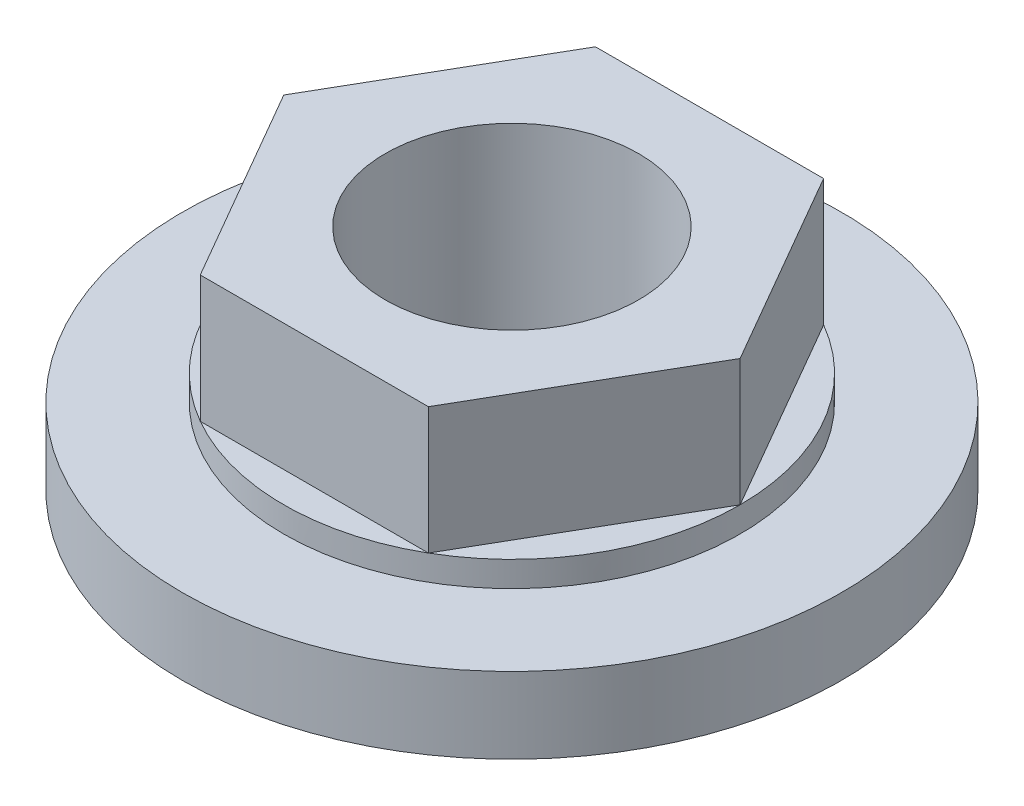
ISO-10303-21;
HEADER;
FILE_DESCRIPTION(('STEP AP214'),'2;1');
FILE_NAME('part.step','',(''),(''),'','','');
FILE_SCHEMA(('AUTOMOTIVE_DESIGN { 1 0 10303 214 1 1 1 1 }'));
ENDSEC;
DATA;
#1=APPLICATION_CONTEXT('core data for automotive mechanical design processes');
#2=APPLICATION_PROTOCOL_DEFINITION('international standard','automotive_design',2000,#1);
#3=PRODUCT_CONTEXT('',#1,'mechanical');
#4=PRODUCT('Part','Part','',(#3));
#5=PRODUCT_RELATED_PRODUCT_CATEGORY('part','',(#4));
#6=PRODUCT_DEFINITION_FORMATION('','',#4);
#7=PRODUCT_DEFINITION_CONTEXT('part definition',#1,'design');
#8=PRODUCT_DEFINITION('design','',#6,#7);
#9=PRODUCT_DEFINITION_SHAPE('','',#8);
#10=(LENGTH_UNIT() NAMED_UNIT(*) SI_UNIT(.MILLI.,.METRE.));
#11=(NAMED_UNIT(*) PLANE_ANGLE_UNIT() SI_UNIT($,.RADIAN.));
#12=(NAMED_UNIT(*) SI_UNIT($,.STERADIAN.) SOLID_ANGLE_UNIT());
#13=UNCERTAINTY_MEASURE_WITH_UNIT(LENGTH_MEASURE(1.E-05),#10,'distance_accuracy_value','');
#14=(GEOMETRIC_REPRESENTATION_CONTEXT(3) GLOBAL_UNCERTAINTY_ASSIGNED_CONTEXT((#13)) GLOBAL_UNIT_ASSIGNED_CONTEXT((#10,
#11,#12)) REPRESENTATION_CONTEXT('',''));
#15=CARTESIAN_POINT('',(0.,0.,0.));
#16=DIRECTION('',(0.,0.,1.));
#17=DIRECTION('',(1.,0.,0.));
#18=AXIS2_PLACEMENT_3D('',#15,#16,#17);
#19=CARTESIAN_POINT('',(0.,2.,0.));
#20=DIRECTION('',(0.,1.,0.));
#21=DIRECTION('',(0.,0.,1.));
#22=AXIS2_PLACEMENT_3D('',#19,#20,#21);
#23=PLANE('',#22);
#24=DIRECTION('',(-0.5,0.,0.866025403784439));
#25=VECTOR('',#24,1.);
#26=CARTESIAN_POINT('',(-2.25,2.,-3.89711431702997));
#27=LINE('',#26,#25);
#28=CARTESIAN_POINT('',(-2.25,2.,-3.89711431702997));
#29=VERTEX_POINT('',#28);
#30=CARTESIAN_POINT('',(-4.5,2.,0.));
#31=VERTEX_POINT('',#30);
#32=EDGE_CURVE('E58',#29,#31,#27,.T.);
#33=ORIENTED_EDGE('',*,*,#32,.F.);
#34=CARTESIAN_POINT('',(0.,2.,0.));
#35=DIRECTION('',(0.,1.,0.));
#36=DIRECTION('',(0.,0.,1.));
#37=AXIS2_PLACEMENT_3D('',#34,#35,#36);
#38=CIRCLE('',#37,4.5);
#39=EDGE_CURVE('E221',#29,#31,#38,.T.);
#40=ORIENTED_EDGE('',*,*,#39,.T.);
#41=EDGE_LOOP('',(#33,#40));
#42=FACE_BOUND('',#41,.T.);
#43=ADVANCED_FACE('F35',(#42),#23,.T.);
#44=DIRECTION('',(-1.,0.,0.));
#45=VECTOR('',#44,1.);
#46=CARTESIAN_POINT('',(2.25,2.,-3.89711431702997));
#47=LINE('',#46,#45);
#48=CARTESIAN_POINT('',(2.25,2.,-3.89711431702997));
#49=VERTEX_POINT('',#48);
#50=EDGE_CURVE('E111',#49,#29,#47,.T.);
#51=ORIENTED_EDGE('',*,*,#50,.F.);
#52=EDGE_CURVE('E217',#49,#29,#38,.T.);
#53=ORIENTED_EDGE('',*,*,#52,.T.);
#54=EDGE_LOOP('',(#51,#53));
#55=FACE_BOUND('',#54,.T.);
#56=ADVANCED_FACE('F146',(#55),#23,.T.);
#57=DIRECTION('',(-0.5,0.,-0.866025403784439));
#58=VECTOR('',#57,1.);
#59=CARTESIAN_POINT('',(4.5,2.,0.));
#60=LINE('',#59,#58);
#61=CARTESIAN_POINT('',(4.5,2.,0.));
#62=VERTEX_POINT('',#61);
#63=EDGE_CURVE('E195',#62,#49,#60,.T.);
#64=ORIENTED_EDGE('',*,*,#63,.F.);
#65=EDGE_CURVE('E125',#62,#49,#38,.T.);
#66=ORIENTED_EDGE('',*,*,#65,.T.);
#67=EDGE_LOOP('',(#64,#66));
#68=FACE_BOUND('',#67,.T.);
#69=ADVANCED_FACE('F151',(#68),#23,.T.);
#70=DIRECTION('',(0.5,0.,-0.866025403784439));
#71=VECTOR('',#70,1.);
#72=CARTESIAN_POINT('',(2.25,2.,3.89711431702997));
#73=LINE('',#72,#71);
#74=CARTESIAN_POINT('',(2.25,2.,3.89711431702997));
#75=VERTEX_POINT('',#74);
#76=EDGE_CURVE('E178',#75,#62,#73,.T.);
#77=ORIENTED_EDGE('',*,*,#76,.F.);
#78=EDGE_CURVE('E123',#75,#62,#38,.T.);
#79=ORIENTED_EDGE('',*,*,#78,.T.);
#80=EDGE_LOOP('',(#77,#79));
#81=FACE_BOUND('',#80,.T.);
#82=ADVANCED_FACE('F161',(#81),#23,.T.);
#83=DIRECTION('',(1.,0.,0.));
#84=VECTOR('',#83,1.);
#85=CARTESIAN_POINT('',(-2.25,2.,3.89711431702998));
#86=LINE('',#85,#84);
#87=CARTESIAN_POINT('',(-2.25,2.,3.89711431702998));
#88=VERTEX_POINT('',#87);
#89=EDGE_CURVE('E172',#88,#75,#86,.T.);
#90=ORIENTED_EDGE('',*,*,#89,.F.);
#91=EDGE_CURVE('E117',#88,#75,#38,.T.);
#92=ORIENTED_EDGE('',*,*,#91,.T.);
#93=EDGE_LOOP('',(#90,#92));
#94=FACE_BOUND('',#93,.T.);
#95=ADVANCED_FACE('F155',(#94),#23,.T.);
#96=CARTESIAN_POINT('',(0.,1.5,0.));
#97=DIRECTION('',(0.,-1.,0.));
#98=DIRECTION('',(0.,0.,-1.));
#99=AXIS2_PLACEMENT_3D('',#96,#97,#98);
#100=CYLINDRICAL_SURFACE('',#99,6.5);
#101=CARTESIAN_POINT('',(0.,1.5,0.));
#102=DIRECTION('',(0.,1.,0.));
#103=DIRECTION('',(0.,0.,1.));
#104=AXIS2_PLACEMENT_3D('',#101,#102,#103);
#105=CIRCLE('',#104,6.5);
#106=CARTESIAN_POINT('',(0.,1.5,6.5));
#107=VERTEX_POINT('',#106);
#108=EDGE_CURVE('E11',#107,#107,#105,.T.);
#109=ORIENTED_EDGE('',*,*,#108,.F.);
#110=EDGE_LOOP('',(#109));
#111=FACE_BOUND('',#110,.T.);
#112=CARTESIAN_POINT('',(0.,0.,0.));
#113=DIRECTION('',(0.,1.,0.));
#114=DIRECTION('',(0.,0.,1.));
#115=AXIS2_PLACEMENT_3D('',#112,#113,#114);
#116=CIRCLE('',#115,6.5);
#117=CARTESIAN_POINT('',(0.,0.,6.5));
#118=VERTEX_POINT('',#117);
#119=EDGE_CURVE('E44',#118,#118,#116,.T.);
#120=ORIENTED_EDGE('',*,*,#119,.T.);
#121=EDGE_LOOP('',(#120));
#122=FACE_BOUND('',#121,.T.);
#123=ADVANCED_FACE('F37',(#111,#122),#100,.T.);
#124=CARTESIAN_POINT('',(0.,1.5,0.));
#125=DIRECTION('',(0.,1.,0.));
#126=DIRECTION('',(0.,0.,1.));
#127=AXIS2_PLACEMENT_3D('',#124,#125,#126);
#128=PLANE('',#127);
#129=CARTESIAN_POINT('',(0.,1.5,0.));
#130=DIRECTION('',(0.,1.,0.));
#131=DIRECTION('',(0.,0.,1.));
#132=AXIS2_PLACEMENT_3D('',#129,#130,#131);
#133=CIRCLE('',#132,4.5);
#134=CARTESIAN_POINT('',(0.,1.5,4.5));
#135=VERTEX_POINT('',#134);
#136=EDGE_CURVE('E114',#135,#135,#133,.T.);
#137=ORIENTED_EDGE('',*,*,#136,.F.);
#138=EDGE_LOOP('',(#137));
#139=FACE_BOUND('',#138,.T.);
#140=ORIENTED_EDGE('',*,*,#108,.T.);
#141=EDGE_LOOP('',(#140));
#142=FACE_BOUND('',#141,.T.);
#143=ADVANCED_FACE('F133',(#139,#142),#128,.T.);
#144=CARTESIAN_POINT('',(0.,0.,0.));
#145=DIRECTION('',(0.,1.,0.));
#146=DIRECTION('',(0.,0.,1.));
#147=AXIS2_PLACEMENT_3D('',#144,#145,#146);
#148=PLANE('',#147);
#149=CARTESIAN_POINT('',(0.,0.,0.));
#150=DIRECTION('',(0.,1.,0.));
#151=DIRECTION('',(0.,0.,1.));
#152=AXIS2_PLACEMENT_3D('',#149,#150,#151);
#153=CIRCLE('',#152,2.5);
#154=CARTESIAN_POINT('',(0.,0.,2.5));
#155=VERTEX_POINT('',#154);
#156=EDGE_CURVE('E39',#155,#155,#153,.T.);
#157=ORIENTED_EDGE('',*,*,#156,.T.);
#158=EDGE_LOOP('',(#157));
#159=FACE_BOUND('',#158,.T.);
#160=ORIENTED_EDGE('',*,*,#119,.F.);
#161=EDGE_LOOP('',(#160));
#162=FACE_BOUND('',#161,.T.);
#163=ADVANCED_FACE('F130',(#159,#162),#148,.F.);
#164=CARTESIAN_POINT('',(0.,2.,0.));
#165=DIRECTION('',(0.,-1.,0.));
#166=DIRECTION('',(0.,0.,-1.));
#167=AXIS2_PLACEMENT_3D('',#164,#165,#166);
#168=CYLINDRICAL_SURFACE('',#167,4.5);
#169=ORIENTED_EDGE('',*,*,#78,.F.);
#170=ORIENTED_EDGE('',*,*,#91,.F.);
#171=EDGE_CURVE('E347',#31,#88,#38,.T.);
#172=ORIENTED_EDGE('',*,*,#171,.F.);
#173=ORIENTED_EDGE('',*,*,#39,.F.);
#174=ORIENTED_EDGE('',*,*,#52,.F.);
#175=ORIENTED_EDGE('',*,*,#65,.F.);
#176=EDGE_LOOP('',(#169,#170,#172,#173,#174,#175));
#177=FACE_BOUND('',#176,.T.);
#178=ORIENTED_EDGE('',*,*,#136,.T.);
#179=EDGE_LOOP('',(#178));
#180=FACE_BOUND('',#179,.T.);
#181=ADVANCED_FACE('F132',(#177,#180),#168,.T.);
#182=DIRECTION('',(0.5,0.,0.866025403784438));
#183=VECTOR('',#182,1.);
#184=CARTESIAN_POINT('',(-4.5,2.,0.));
#185=LINE('',#184,#183);
#186=EDGE_CURVE('E51',#31,#88,#185,.T.);
#187=ORIENTED_EDGE('',*,*,#186,.F.);
#188=ORIENTED_EDGE('',*,*,#171,.T.);
#189=EDGE_LOOP('',(#187,#188));
#190=FACE_BOUND('',#189,.T.);
#191=ADVANCED_FACE('F139',(#190),#23,.T.);
#192=CARTESIAN_POINT('',(0.,4.5,0.));
#193=DIRECTION('',(0.,1.,0.));
#194=DIRECTION('',(0.,0.,1.));
#195=AXIS2_PLACEMENT_3D('',#192,#193,#194);
#196=PLANE('',#195);
#197=DIRECTION('',(-0.5,0.,0.866025403784439));
#198=VECTOR('',#197,1.);
#199=CARTESIAN_POINT('',(-2.25,4.5,-3.89711431702997));
#200=LINE('',#199,#198);
#201=CARTESIAN_POINT('',(-2.25,4.5,-3.89711431702997));
#202=VERTEX_POINT('',#201);
#203=CARTESIAN_POINT('',(-4.5,4.5,0.));
#204=VERTEX_POINT('',#203);
#205=EDGE_CURVE('E101',#202,#204,#200,.T.);
#206=ORIENTED_EDGE('',*,*,#205,.T.);
#207=DIRECTION('',(0.5,0.,0.866025403784438));
#208=VECTOR('',#207,1.);
#209=CARTESIAN_POINT('',(-4.5,4.5,0.));
#210=LINE('',#209,#208);
#211=CARTESIAN_POINT('',(-2.25,4.5,3.89711431702998));
#212=VERTEX_POINT('',#211);
#213=EDGE_CURVE('E91',#204,#212,#210,.T.);
#214=ORIENTED_EDGE('',*,*,#213,.T.);
#215=DIRECTION('',(1.,0.,0.));
#216=VECTOR('',#215,1.);
#217=CARTESIAN_POINT('',(-2.25,4.5,3.89711431702998));
#218=LINE('',#217,#216);
#219=CARTESIAN_POINT('',(2.25,4.5,3.89711431702997));
#220=VERTEX_POINT('',#219);
#221=EDGE_CURVE('E100',#212,#220,#218,.T.);
#222=ORIENTED_EDGE('',*,*,#221,.T.);
#223=DIRECTION('',(0.5,0.,-0.866025403784439));
#224=VECTOR('',#223,1.);
#225=CARTESIAN_POINT('',(2.25,4.5,3.89711431702997));
#226=LINE('',#225,#224);
#227=CARTESIAN_POINT('',(4.5,4.5,0.));
#228=VERTEX_POINT('',#227);
#229=EDGE_CURVE('E183',#220,#228,#226,.T.);
#230=ORIENTED_EDGE('',*,*,#229,.T.);
#231=DIRECTION('',(-0.5,0.,-0.866025403784439));
#232=VECTOR('',#231,1.);
#233=CARTESIAN_POINT('',(4.5,4.5,0.));
#234=LINE('',#233,#232);
#235=CARTESIAN_POINT('',(2.25,4.5,-3.89711431702997));
#236=VERTEX_POINT('',#235);
#237=EDGE_CURVE('E185',#228,#236,#234,.T.);
#238=ORIENTED_EDGE('',*,*,#237,.T.);
#239=DIRECTION('',(-1.,0.,0.));
#240=VECTOR('',#239,1.);
#241=CARTESIAN_POINT('',(2.25,4.5,-3.89711431702997));
#242=LINE('',#241,#240);
#243=EDGE_CURVE('E107',#236,#202,#242,.T.);
#244=ORIENTED_EDGE('',*,*,#243,.T.);
#245=EDGE_LOOP('',(#206,#214,#222,#230,#238,#244));
#246=FACE_BOUND('',#245,.T.);
#247=CARTESIAN_POINT('',(0.,4.5,0.));
#248=DIRECTION('',(0.,1.,0.));
#249=DIRECTION('',(0.,0.,1.));
#250=AXIS2_PLACEMENT_3D('',#247,#248,#249);
#251=CIRCLE('',#250,2.5);
#252=CARTESIAN_POINT('',(0.,4.5,2.5));
#253=VERTEX_POINT('',#252);
#254=EDGE_CURVE('E191',#253,#253,#251,.T.);
#255=ORIENTED_EDGE('',*,*,#254,.F.);
#256=EDGE_LOOP('',(#255));
#257=FACE_BOUND('',#256,.T.);
#258=ADVANCED_FACE('F104',(#246,#257),#196,.T.);
#259=CARTESIAN_POINT('',(-2.25,4.5,-3.89711431702997));
#260=DIRECTION('',(0.866025403784439,0.,0.5));
#261=DIRECTION('',(0.5,0.,-0.866025403784439));
#262=AXIS2_PLACEMENT_3D('',#259,#260,#261);
#263=PLANE('',#262);
#264=ORIENTED_EDGE('',*,*,#32,.T.);
#265=DIRECTION('',(0.,-1.,0.));
#266=VECTOR('',#265,1.);
#267=CARTESIAN_POINT('',(-4.5,4.5,0.));
#268=LINE('',#267,#266);
#269=EDGE_CURVE('E95',#204,#31,#268,.T.);
#270=ORIENTED_EDGE('',*,*,#269,.F.);
#271=ORIENTED_EDGE('',*,*,#205,.F.);
#272=DIRECTION('',(0.,-1.,0.));
#273=VECTOR('',#272,1.);
#274=CARTESIAN_POINT('',(-2.25,4.5,-3.89711431702997));
#275=LINE('',#274,#273);
#276=EDGE_CURVE('E190',#202,#29,#275,.T.);
#277=ORIENTED_EDGE('',*,*,#276,.T.);
#278=EDGE_LOOP('',(#264,#270,#271,#277));
#279=FACE_BOUND('',#278,.T.);
#280=ADVANCED_FACE('F113',(#279),#263,.F.);
#281=CARTESIAN_POINT('',(-4.5,4.5,0.));
#282=DIRECTION('',(0.866025403784438,0.,-0.5));
#283=DIRECTION('',(-0.5,0.,-0.866025403784439));
#284=AXIS2_PLACEMENT_3D('',#281,#282,#283);
#285=PLANE('',#284);
#286=ORIENTED_EDGE('',*,*,#186,.T.);
#287=DIRECTION('',(0.,-1.,0.));
#288=VECTOR('',#287,1.);
#289=CARTESIAN_POINT('',(-2.25,4.5,3.89711431702998));
#290=LINE('',#289,#288);
#291=EDGE_CURVE('E97',#212,#88,#290,.T.);
#292=ORIENTED_EDGE('',*,*,#291,.F.);
#293=ORIENTED_EDGE('',*,*,#213,.F.);
#294=ORIENTED_EDGE('',*,*,#269,.T.);
#295=EDGE_LOOP('',(#286,#292,#293,#294));
#296=FACE_BOUND('',#295,.T.);
#297=ADVANCED_FACE('F93',(#296),#285,.F.);
#298=CARTESIAN_POINT('',(-2.25,4.5,3.89711431702998));
#299=DIRECTION('',(0.,0.,-1.));
#300=DIRECTION('',(-1.,0.,0.));
#301=AXIS2_PLACEMENT_3D('',#298,#299,#300);
#302=PLANE('',#301);
#303=ORIENTED_EDGE('',*,*,#89,.T.);
#304=DIRECTION('',(0.,-1.,0.));
#305=VECTOR('',#304,1.);
#306=CARTESIAN_POINT('',(2.25,4.5,3.89711431702997));
#307=LINE('',#306,#305);
#308=EDGE_CURVE('E119',#220,#75,#307,.T.);
#309=ORIENTED_EDGE('',*,*,#308,.F.);
#310=ORIENTED_EDGE('',*,*,#221,.F.);
#311=ORIENTED_EDGE('',*,*,#291,.T.);
#312=EDGE_LOOP('',(#303,#309,#310,#311));
#313=FACE_BOUND('',#312,.T.);
#314=ADVANCED_FACE('F181',(#313),#302,.F.);
#315=CARTESIAN_POINT('',(2.25,4.5,3.89711431702997));
#316=DIRECTION('',(-0.866025403784439,0.,-0.5));
#317=DIRECTION('',(-0.5,0.,0.866025403784439));
#318=AXIS2_PLACEMENT_3D('',#315,#316,#317);
#319=PLANE('',#318);
#320=ORIENTED_EDGE('',*,*,#76,.T.);
#321=DIRECTION('',(0.,-1.,0.));
#322=VECTOR('',#321,1.);
#323=CARTESIAN_POINT('',(4.5,4.5,0.));
#324=LINE('',#323,#322);
#325=EDGE_CURVE('E204',#228,#62,#324,.T.);
#326=ORIENTED_EDGE('',*,*,#325,.F.);
#327=ORIENTED_EDGE('',*,*,#229,.F.);
#328=ORIENTED_EDGE('',*,*,#308,.T.);
#329=EDGE_LOOP('',(#320,#326,#327,#328));
#330=FACE_BOUND('',#329,.T.);
#331=ADVANCED_FACE('F207',(#330),#319,.F.);
#332=CARTESIAN_POINT('',(4.5,4.5,0.));
#333=DIRECTION('',(-0.866025403784439,0.,0.5));
#334=DIRECTION('',(0.5,0.,0.866025403784439));
#335=AXIS2_PLACEMENT_3D('',#332,#333,#334);
#336=PLANE('',#335);
#337=ORIENTED_EDGE('',*,*,#63,.T.);
#338=DIRECTION('',(0.,-1.,0.));
#339=VECTOR('',#338,1.);
#340=CARTESIAN_POINT('',(2.25,4.5,-3.89711431702997));
#341=LINE('',#340,#339);
#342=EDGE_CURVE('E201',#236,#49,#341,.T.);
#343=ORIENTED_EDGE('',*,*,#342,.F.);
#344=ORIENTED_EDGE('',*,*,#237,.F.);
#345=ORIENTED_EDGE('',*,*,#325,.T.);
#346=EDGE_LOOP('',(#337,#343,#344,#345));
#347=FACE_BOUND('',#346,.T.);
#348=ADVANCED_FACE('F212',(#347),#336,.F.);
#349=CARTESIAN_POINT('',(2.25,4.5,-3.89711431702997));
#350=DIRECTION('',(0.,0.,1.));
#351=DIRECTION('',(1.,0.,0.));
#352=AXIS2_PLACEMENT_3D('',#349,#350,#351);
#353=PLANE('',#352);
#354=ORIENTED_EDGE('',*,*,#50,.T.);
#355=ORIENTED_EDGE('',*,*,#276,.F.);
#356=ORIENTED_EDGE('',*,*,#243,.F.);
#357=ORIENTED_EDGE('',*,*,#342,.T.);
#358=EDGE_LOOP('',(#354,#355,#356,#357));
#359=FACE_BOUND('',#358,.T.);
#360=ADVANCED_FACE('F214',(#359),#353,.F.);
#361=CARTESIAN_POINT('',(0.,4.5,0.));
#362=DIRECTION('',(0.,-1.,0.));
#363=DIRECTION('',(0.,0.,-1.));
#364=AXIS2_PLACEMENT_3D('',#361,#362,#363);
#365=CYLINDRICAL_SURFACE('',#364,2.5);
#366=ORIENTED_EDGE('',*,*,#254,.T.);
#367=EDGE_LOOP('',(#366));
#368=FACE_BOUND('',#367,.T.);
#369=ORIENTED_EDGE('',*,*,#156,.F.);
#370=EDGE_LOOP('',(#369));
#371=FACE_BOUND('',#370,.T.);
#372=ADVANCED_FACE('F301',(#368,#371),#365,.F.);
#373=CLOSED_SHELL('',(#43,#56,#69,#82,#95,#123,#143,#163,#181,#191,#258,#280,#297,#314,#331,
#348,#360,#372));
#374=MANIFOLD_SOLID_BREP('B2',#373);
#375=ADVANCED_BREP_SHAPE_REPRESENTATION('',(#18,#374),#14);
#376=SHAPE_DEFINITION_REPRESENTATION(#9,#375);
ENDSEC;
END-ISO-10303-21;
